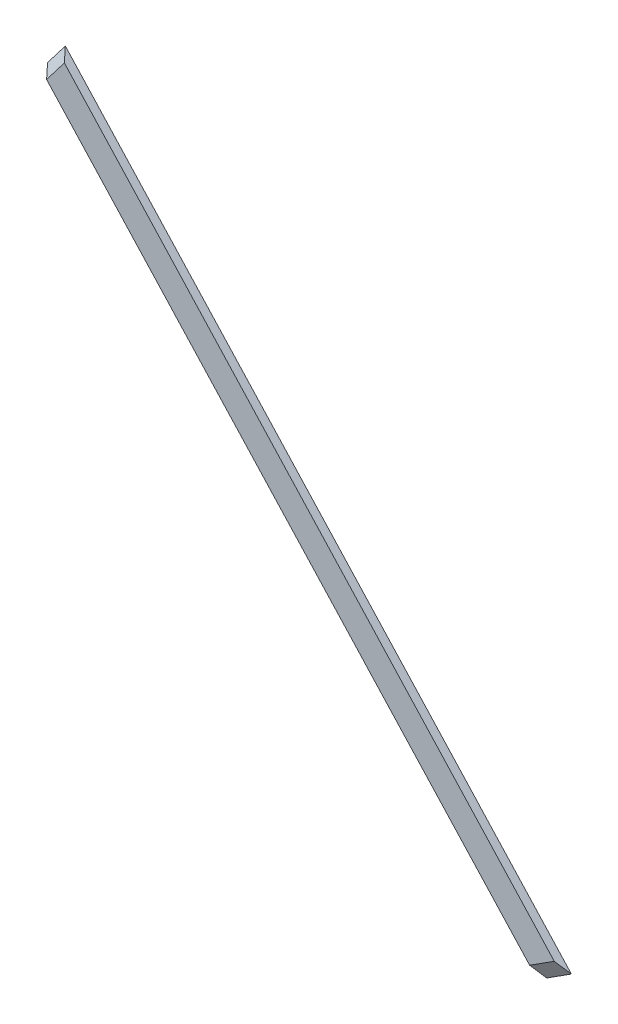
ISO-10303-21;
HEADER;
FILE_DESCRIPTION(('STEP AP214'),'2;1');
FILE_NAME('part.step','',(''),(''),'','','');
FILE_SCHEMA(('AUTOMOTIVE_DESIGN { 1 0 10303 214 1 1 1 1 }'));
ENDSEC;
DATA;
#1=APPLICATION_CONTEXT('core data for automotive mechanical design processes');
#2=APPLICATION_PROTOCOL_DEFINITION('international standard','automotive_design',2000,#1);
#3=PRODUCT_CONTEXT('',#1,'mechanical');
#4=PRODUCT('Part','Part','',(#3));
#5=PRODUCT_RELATED_PRODUCT_CATEGORY('part','',(#4));
#6=PRODUCT_DEFINITION_FORMATION('','',#4);
#7=PRODUCT_DEFINITION_CONTEXT('part definition',#1,'design');
#8=PRODUCT_DEFINITION('design','',#6,#7);
#9=PRODUCT_DEFINITION_SHAPE('','',#8);
#10=(LENGTH_UNIT() NAMED_UNIT(*) SI_UNIT(.MILLI.,.METRE.));
#11=(NAMED_UNIT(*) PLANE_ANGLE_UNIT() SI_UNIT($,.RADIAN.));
#12=(NAMED_UNIT(*) SI_UNIT($,.STERADIAN.) SOLID_ANGLE_UNIT());
#13=UNCERTAINTY_MEASURE_WITH_UNIT(LENGTH_MEASURE(1.E-05),#10,'distance_accuracy_value','');
#14=(GEOMETRIC_REPRESENTATION_CONTEXT(3) GLOBAL_UNCERTAINTY_ASSIGNED_CONTEXT((#13)) GLOBAL_UNIT_ASSIGNED_CONTEXT((#10,
#11,#12)) REPRESENTATION_CONTEXT('',''));
#15=CARTESIAN_POINT('',(0.,0.,0.));
#16=DIRECTION('',(0.,0.,1.));
#17=DIRECTION('',(1.,0.,0.));
#18=AXIS2_PLACEMENT_3D('',#15,#16,#17);
#19=CARTESIAN_POINT('',(0.,0.,0.));
#20=DIRECTION('',(-0.467086179481356,0.356822089773095,0.809016994374946));
#21=DIRECTION('',(0.866025403784439,0.,0.5));
#22=AXIS2_PLACEMENT_3D('',#19,#20,#21);
#23=PLANE('',#22);
#24=DIRECTION('',(0.607061998206693,0.794654472291761,0.));
#25=VECTOR('',#24,1.);
#26=CARTESIAN_POINT('',(27.1270322112081,-20.723208581537,24.8019022697678));
#27=LINE('',#26,#25);
#28=CARTESIAN_POINT('',(4515.13685118348,5854.15791537469,24.8019022697678));
#29=VERTEX_POINT('',#28);
#30=CARTESIAN_POINT('',(4577.27924741557,5935.50336811368,24.8019022697678));
#31=VERTEX_POINT('',#30);
#32=EDGE_CURVE('E49',#29,#31,#27,.T.);
#33=ORIENTED_EDGE('',*,*,#32,.T.);
#34=DIRECTION('',(-0.498272048507418,0.649629504367773,-0.574200725122412));
#35=VECTOR('',#34,1.);
#36=CARTESIAN_POINT('',(5355.03534350731,4921.49243024031,921.075565787549));
#37=LINE('',#36,#35);
#38=CARTESIAN_POINT('',(4555.75699202616,5963.56332480476,-2.36496889041897E-12));
#39=VERTEX_POINT('',#38);
#40=EDGE_CURVE('E106',#31,#39,#37,.T.);
#41=ORIENTED_EDGE('',*,*,#40,.T.);
#42=DIRECTION('',(-0.607061998206687,-0.794654472291766,0.));
#43=VECTOR('',#42,1.);
#44=CARTESIAN_POINT('',(0.,0.,0.));
#45=LINE('',#44,#43);
#46=CARTESIAN_POINT('',(4493.61459579409,5882.21787206576,0.));
#47=VERTEX_POINT('',#46);
#48=EDGE_CURVE('E93',#39,#47,#45,.T.);
#49=ORIENTED_EDGE('',*,*,#48,.T.);
#50=DIRECTION('',(0.498272048507418,-0.649629504367773,0.574200725122412));
#51=VECTOR('',#50,1.);
#52=CARTESIAN_POINT('',(5281.99046233048,4854.36125243857,908.511716822591));
#53=LINE('',#52,#51);
#54=EDGE_CURVE('E98',#47,#29,#53,.T.);
#55=ORIENTED_EDGE('',*,*,#54,.T.);
#56=EDGE_LOOP('',(#33,#41,#49,#55));
#57=FACE_BOUND('',#56,.T.);
#58=ADVANCED_FACE('F45',(#57),#23,.T.);
#59=CARTESIAN_POINT('',(0.,0.,24.8019022697678));
#60=DIRECTION('',(0.,0.,1.));
#61=DIRECTION('',(1.,0.,0.));
#62=AXIS2_PLACEMENT_3D('',#59,#60,#61);
#63=PLANE('',#62);
#64=DIRECTION('',(0.842960923517789,0.537974796270268,0.));
#65=VECTOR('',#64,1.);
#66=CARTESIAN_POINT('',(-25.345158587394,39.7137160284385,24.8019022697678));
#67=LINE('',#66,#65);
#68=CARTESIAN_POINT('',(6204.72943876668,4015.72614881519,24.8019022697678));
#69=VERTEX_POINT('',#68);
#70=CARTESIAN_POINT('',(6291.01982075757,4070.79637731156,24.8019022697678));
#71=VERTEX_POINT('',#70);
#72=EDGE_CURVE('E114',#69,#71,#67,.T.);
#73=ORIENTED_EDGE('',*,*,#72,.T.);
#74=DIRECTION('',(-0.676673678812601,0.736283051823292,0.));
#75=VECTOR('',#74,1.);
#76=CARTESIAN_POINT('',(5438.60779899973,4998.29887141187,24.8019022697678));
#77=LINE('',#76,#75);
#78=EDGE_CURVE('E69',#71,#31,#77,.T.);
#79=ORIENTED_EDGE('',*,*,#78,.T.);
#80=ORIENTED_EDGE('',*,*,#32,.F.);
#81=DIRECTION('',(0.676673678812601,-0.736283051823292,0.));
#82=VECTOR('',#81,1.);
#83=CARTESIAN_POINT('',(5364.39140988824,4930.09103079419,24.8019022697678));
#84=LINE('',#83,#82);
#85=EDGE_CURVE('E101',#29,#69,#84,.T.);
#86=ORIENTED_EDGE('',*,*,#85,.T.);
#87=EDGE_LOOP('',(#73,#79,#80,#86));
#88=FACE_BOUND('',#87,.T.);
#89=ADVANCED_FACE('F119',(#88),#63,.T.);
#90=CARTESIAN_POINT('',(0.,0.,0.));
#91=DIRECTION('',(0.250607512160671,-0.392680737752119,0.884871579974796));
#92=DIRECTION('',(0.,-0.914039707413188,-0.405624719749689));
#93=AXIS2_PLACEMENT_3D('',#90,#91,#92);
#94=PLANE('',#93);
#95=DIRECTION('',(0.842960923517798,0.537974796270254,0.));
#96=VECTOR('',#95,1.);
#97=CARTESIAN_POINT('',(0.,0.,0.));
#98=LINE('',#97,#96);
#99=CARTESIAN_POINT('',(6239.79349851177,3982.21500247212,-3.33066907387547E-13));
#100=VERTEX_POINT('',#99);
#101=CARTESIAN_POINT('',(6326.08388050264,4037.28523096847,-1.55431223447522E-12));
#102=VERTEX_POINT('',#101);
#103=EDGE_CURVE('E94',#100,#102,#98,.T.);
#104=ORIENTED_EDGE('',*,*,#103,.T.);
#105=DIRECTION('',(-0.643662317162795,0.615155867938901,0.455282417412489));
#106=VECTOR('',#105,1.);
#107=CARTESIAN_POINT('',(5303.75366485117,5014.33859320564,723.126023638079));
#108=LINE('',#107,#106);
#109=EDGE_CURVE('E62',#102,#71,#108,.T.);
#110=ORIENTED_EDGE('',*,*,#109,.T.);
#111=ORIENTED_EDGE('',*,*,#72,.F.);
#112=DIRECTION('',(0.643662317162794,-0.615155867938901,-0.455282417412489));
#113=VECTOR('',#112,1.);
#114=CARTESIAN_POINT('',(5231.40828683047,4945.94095561298,713.262287717725));
#115=LINE('',#114,#113);
#116=EDGE_CURVE('E111',#69,#100,#115,.T.);
#117=ORIENTED_EDGE('',*,*,#116,.T.);
#118=EDGE_LOOP('',(#104,#110,#111,#117));
#119=FACE_BOUND('',#118,.T.);
#120=ADVANCED_FACE('F118',(#119),#94,.T.);
#121=CARTESIAN_POINT('',(0.,0.,0.));
#122=DIRECTION('',(0.,0.,1.));
#123=DIRECTION('',(1.,0.,0.));
#124=AXIS2_PLACEMENT_3D('',#121,#122,#123);
#125=PLANE('',#124);
#126=ORIENTED_EDGE('',*,*,#103,.F.);
#127=DIRECTION('',(-0.676673678812601,0.736283051823292,0.));
#128=VECTOR('',#127,1.);
#129=CARTESIAN_POINT('',(5366.70404715288,4932.21643726899,0.));
#130=LINE('',#129,#128);
#131=EDGE_CURVE('E12',#100,#47,#130,.T.);
#132=ORIENTED_EDGE('',*,*,#131,.T.);
#133=ORIENTED_EDGE('',*,*,#48,.F.);
#134=DIRECTION('',(-0.676673678812601,0.736283051823293,0.));
#135=VECTOR('',#134,1.);
#136=CARTESIAN_POINT('',(5440.92043626438,5000.42427788666,2.77555756156289E-12));
#137=LINE('',#136,#135);
#138=EDGE_CURVE('E54',#102,#39,#137,.T.);
#139=ORIENTED_EDGE('',*,*,#138,.F.);
#140=EDGE_LOOP('',(#126,#132,#133,#139));
#141=FACE_BOUND('',#140,.T.);
#142=ADVANCED_FACE('F91',(#141),#125,.F.);
#143=CARTESIAN_POINT('',(5281.99046233046,4854.36125243859,908.511716822623));
#144=DIRECTION('',(0.730448811768304,0.671311778017372,0.125638489649576));
#145=DIRECTION('',(-0.676673678812601,0.736283051823292,0.));
#146=AXIS2_PLACEMENT_3D('',#143,#144,#145);
#147=PLANE('',#146);
#148=ORIENTED_EDGE('',*,*,#116,.F.);
#149=ORIENTED_EDGE('',*,*,#85,.F.);
#150=ORIENTED_EDGE('',*,*,#54,.F.);
#151=ORIENTED_EDGE('',*,*,#131,.F.);
#152=EDGE_LOOP('',(#148,#149,#150,#151));
#153=FACE_BOUND('',#152,.T.);
#154=ADVANCED_FACE('F99',(#153),#147,.F.);
#155=CARTESIAN_POINT('',(5355.03534350729,4921.49243024033,921.075565787582));
#156=DIRECTION('',(-0.730448811768304,-0.671311778017372,-0.125638489649577));
#157=DIRECTION('',(0.676673678812601,-0.736283051823292,0.));
#158=AXIS2_PLACEMENT_3D('',#155,#156,#157);
#159=PLANE('',#158);
#160=ORIENTED_EDGE('',*,*,#109,.F.);
#161=ORIENTED_EDGE('',*,*,#138,.T.);
#162=ORIENTED_EDGE('',*,*,#40,.F.);
#163=ORIENTED_EDGE('',*,*,#78,.F.);
#164=EDGE_LOOP('',(#160,#161,#162,#163));
#165=FACE_BOUND('',#164,.T.);
#166=ADVANCED_FACE('F47',(#165),#159,.F.);
#167=CLOSED_SHELL('',(#58,#89,#120,#142,#154,#166));
#168=MANIFOLD_SOLID_BREP('B2',#167);
#169=ADVANCED_BREP_SHAPE_REPRESENTATION('',(#18,#168),#14);
#170=SHAPE_DEFINITION_REPRESENTATION(#9,#169);
ENDSEC;
END-ISO-10303-21;
